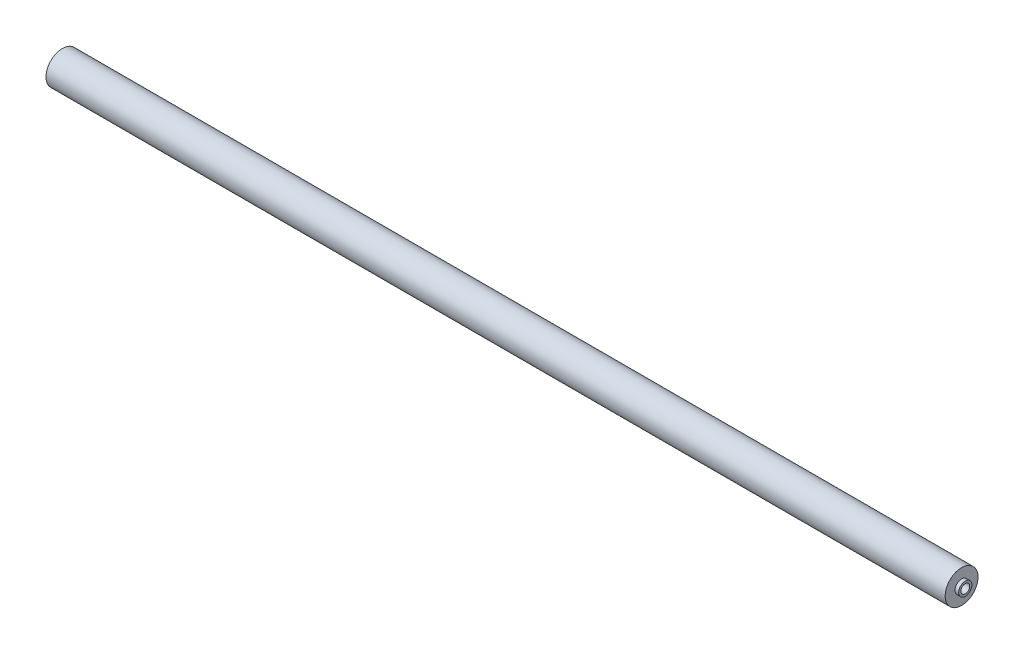
ISO-10303-21;
HEADER;
FILE_DESCRIPTION(('STEP AP214'),'2;1');
FILE_NAME('part.step','',(''),(''),'','','');
FILE_SCHEMA(('AUTOMOTIVE_DESIGN { 1 0 10303 214 1 1 1 1 }'));
ENDSEC;
DATA;
#1=APPLICATION_CONTEXT('core data for automotive mechanical design processes');
#2=APPLICATION_PROTOCOL_DEFINITION('international standard','automotive_design',2000,#1);
#3=PRODUCT_CONTEXT('',#1,'mechanical');
#4=PRODUCT('Part','Part','',(#3));
#5=PRODUCT_RELATED_PRODUCT_CATEGORY('part','',(#4));
#6=PRODUCT_DEFINITION_FORMATION('','',#4);
#7=PRODUCT_DEFINITION_CONTEXT('part definition',#1,'design');
#8=PRODUCT_DEFINITION('design','',#6,#7);
#9=PRODUCT_DEFINITION_SHAPE('','',#8);
#10=(LENGTH_UNIT() NAMED_UNIT(*) SI_UNIT(.MILLI.,.METRE.));
#11=(NAMED_UNIT(*) PLANE_ANGLE_UNIT() SI_UNIT($,.RADIAN.));
#12=(NAMED_UNIT(*) SI_UNIT($,.STERADIAN.) SOLID_ANGLE_UNIT());
#13=UNCERTAINTY_MEASURE_WITH_UNIT(LENGTH_MEASURE(1.E-05),#10,'distance_accuracy_value','');
#14=(GEOMETRIC_REPRESENTATION_CONTEXT(3) GLOBAL_UNCERTAINTY_ASSIGNED_CONTEXT((#13)) GLOBAL_UNIT_ASSIGNED_CONTEXT((#10,
#11,#12)) REPRESENTATION_CONTEXT('',''));
#15=CARTESIAN_POINT('',(0.,0.,0.));
#16=DIRECTION('',(0.,0.,1.));
#17=DIRECTION('',(1.,0.,0.));
#18=AXIS2_PLACEMENT_3D('',#15,#16,#17);
#19=CARTESIAN_POINT('',(-610.1,134.859540351136,0.));
#20=DIRECTION('',(1.,0.,0.));
#21=DIRECTION('',(0.,0.,-1.));
#22=AXIS2_PLACEMENT_3D('',#19,#20,#21);
#23=PLANE('',#22);
#24=CARTESIAN_POINT('',(-610.1,125.334540351136,0.));
#25=DIRECTION('',(-1.,0.,0.));
#26=DIRECTION('',(0.,0.,1.));
#27=AXIS2_PLACEMENT_3D('',#24,#25,#26);
#28=CIRCLE('',#27,4.56187038952058);
#29=CARTESIAN_POINT('',(-610.1,125.334540351136,4.56187038952058));
#30=VERTEX_POINT('',#29);
#31=EDGE_CURVE('E115',#30,#30,#28,.T.);
#32=ORIENTED_EDGE('',*,*,#31,.F.);
#33=EDGE_LOOP('',(#32));
#34=FACE_BOUND('',#33,.T.);
#35=CARTESIAN_POINT('',(-610.1,125.334540351136,0.));
#36=DIRECTION('',(-1.,0.,0.));
#37=DIRECTION('',(0.,0.,1.));
#38=AXIS2_PLACEMENT_3D('',#35,#36,#37);
#39=CIRCLE('',#38,9.52500000000003);
#40=CARTESIAN_POINT('',(-610.1,125.334540351136,9.52500000000003));
#41=VERTEX_POINT('',#40);
#42=EDGE_CURVE('E11',#41,#41,#39,.T.);
#43=ORIENTED_EDGE('',*,*,#42,.T.);
#44=EDGE_LOOP('',(#43));
#45=FACE_BOUND('',#44,.T.);
#46=ADVANCED_FACE('F32',(#34,#45),#23,.F.);
#47=CARTESIAN_POINT('',(-669.436923844671,125.334540351136,0.));
#48=DIRECTION('',(-1.,0.,0.));
#49=DIRECTION('',(0.,0.,1.));
#50=AXIS2_PLACEMENT_3D('',#47,#48,#49);
#51=CYLINDRICAL_SURFACE('',#50,9.52500000000002);
#52=ORIENTED_EDGE('',*,*,#42,.F.);
#53=EDGE_LOOP('',(#52));
#54=FACE_BOUND('',#53,.T.);
#55=CARTESIAN_POINT('',(-88.9,125.334540351136,0.));
#56=DIRECTION('',(-1.,0.,0.));
#57=DIRECTION('',(0.,0.,1.));
#58=AXIS2_PLACEMENT_3D('',#55,#56,#57);
#59=CIRCLE('',#58,9.52500000000001);
#60=CARTESIAN_POINT('',(-88.9,125.334540351136,9.52500000000001));
#61=VERTEX_POINT('',#60);
#62=EDGE_CURVE('E39',#61,#61,#59,.T.);
#63=ORIENTED_EDGE('',*,*,#62,.T.);
#64=EDGE_LOOP('',(#63));
#65=FACE_BOUND('',#64,.T.);
#66=ADVANCED_FACE('F76',(#54,#65),#51,.T.);
#67=CARTESIAN_POINT('',(-88.8999999999999,134.859540351136,0.));
#68=DIRECTION('',(-1.,0.,0.));
#69=DIRECTION('',(0.,0.,1.));
#70=AXIS2_PLACEMENT_3D('',#67,#68,#69);
#71=PLANE('',#70);
#72=ORIENTED_EDGE('',*,*,#62,.F.);
#73=EDGE_LOOP('',(#72));
#74=FACE_BOUND('',#73,.T.);
#75=CARTESIAN_POINT('',(-88.9,125.334540351136,0.));
#76=DIRECTION('',(-1.,0.,0.));
#77=DIRECTION('',(0.,0.,1.));
#78=AXIS2_PLACEMENT_3D('',#75,#76,#77);
#79=CIRCLE('',#78,3.82166881173637);
#80=CARTESIAN_POINT('',(-88.9,125.334540351136,3.82166881173637));
#81=VERTEX_POINT('',#80);
#82=EDGE_CURVE('E71',#81,#81,#79,.T.);
#83=ORIENTED_EDGE('',*,*,#82,.T.);
#84=EDGE_LOOP('',(#83));
#85=FACE_BOUND('',#84,.T.);
#86=ADVANCED_FACE('F78',(#74,#85),#71,.F.);
#87=CARTESIAN_POINT('',(-669.436923844671,125.334540351136,0.));
#88=DIRECTION('',(-1.,0.,0.));
#89=DIRECTION('',(0.,0.,1.));
#90=AXIS2_PLACEMENT_3D('',#87,#88,#89);
#91=CYLINDRICAL_SURFACE('',#90,3.82166881173637);
#92=ORIENTED_EDGE('',*,*,#82,.F.);
#93=EDGE_LOOP('',(#92));
#94=FACE_BOUND('',#93,.T.);
#95=CARTESIAN_POINT('',(-86.7667228234836,125.334540351136,0.));
#96=DIRECTION('',(-1.,0.,0.));
#97=DIRECTION('',(0.,0.,1.));
#98=AXIS2_PLACEMENT_3D('',#95,#96,#97);
#99=CIRCLE('',#98,3.82166881173637);
#100=CARTESIAN_POINT('',(-86.7667228234836,125.334540351136,3.82166881173637));
#101=VERTEX_POINT('',#100);
#102=EDGE_CURVE('E68',#101,#101,#99,.T.);
#103=ORIENTED_EDGE('',*,*,#102,.T.);
#104=EDGE_LOOP('',(#103));
#105=FACE_BOUND('',#104,.T.);
#106=ADVANCED_FACE('F81',(#94,#105),#91,.T.);
#107=CARTESIAN_POINT('',(-86.7667228234836,129.156209162872,0.));
#108=DIRECTION('',(-1.,0.,0.));
#109=DIRECTION('',(0.,0.,1.));
#110=AXIS2_PLACEMENT_3D('',#107,#108,#109);
#111=PLANE('',#110);
#112=ORIENTED_EDGE('',*,*,#102,.F.);
#113=EDGE_LOOP('',(#112));
#114=FACE_BOUND('',#113,.T.);
#115=CARTESIAN_POINT('',(-86.7667228234836,125.334540351136,0.));
#116=DIRECTION('',(-1.,0.,0.));
#117=DIRECTION('',(0.,0.,1.));
#118=AXIS2_PLACEMENT_3D('',#115,#116,#117);
#119=CIRCLE('',#118,2.57361127371544);
#120=CARTESIAN_POINT('',(-86.7667228234836,125.334540351136,2.57361127371544));
#121=VERTEX_POINT('',#120);
#122=EDGE_CURVE('E59',#121,#121,#119,.T.);
#123=ORIENTED_EDGE('',*,*,#122,.T.);
#124=EDGE_LOOP('',(#123));
#125=FACE_BOUND('',#124,.T.);
#126=ADVANCED_FACE('F87',(#114,#125),#111,.F.);
#127=CARTESIAN_POINT('',(-669.436923844671,125.334540351136,0.));
#128=DIRECTION('',(-1.,0.,0.));
#129=DIRECTION('',(0.,0.,1.));
#130=AXIS2_PLACEMENT_3D('',#127,#128,#129);
#131=CYLINDRICAL_SURFACE('',#130,2.57361127371544);
#132=ORIENTED_EDGE('',*,*,#122,.F.);
#133=EDGE_LOOP('',(#132));
#134=FACE_BOUND('',#133,.T.);
#135=CARTESIAN_POINT('',(-91.5380564772477,125.334540351136,0.));
#136=DIRECTION('',(-1.,0.,0.));
#137=DIRECTION('',(0.,0.,1.));
#138=AXIS2_PLACEMENT_3D('',#135,#136,#137);
#139=CIRCLE('',#138,2.57361127371544);
#140=CARTESIAN_POINT('',(-91.5380564772477,125.334540351136,2.57361127371544));
#141=VERTEX_POINT('',#140);
#142=EDGE_CURVE('E55',#141,#141,#139,.T.);
#143=ORIENTED_EDGE('',*,*,#142,.T.);
#144=EDGE_LOOP('',(#143));
#145=FACE_BOUND('',#144,.T.);
#146=ADVANCED_FACE('F93',(#134,#145),#131,.F.);
#147=CARTESIAN_POINT('',(-93.3610656563957,125.334540351136,0.));
#148=DIRECTION('',(1.,0.,0.));
#149=DIRECTION('',(0.,0.,-1.));
#150=AXIS2_PLACEMENT_3D('',#147,#148,#149);
#151=CONICAL_SURFACE('',#150,0.,0.954490455959782);
#152=ORIENTED_EDGE('',*,*,#142,.F.);
#153=EDGE_LOOP('',(#152));
#154=FACE_BOUND('',#153,.T.);
#155=CARTESIAN_POINT('',(-93.3610656563957,125.334540351136,0.));
#156=VERTEX_POINT('',#155);
#157=VERTEX_LOOP('',#156);
#158=FACE_BOUND('',#157,.T.);
#159=ADVANCED_FACE('F49',(#154,#158),#151,.F.);
#160=CARTESIAN_POINT('',(-605.901094644352,125.334540351136,0.));
#161=DIRECTION('',(-1.,0.,0.));
#162=DIRECTION('',(0.,0.,1.));
#163=AXIS2_PLACEMENT_3D('',#160,#161,#162);
#164=CONICAL_SURFACE('',#163,2.57361127371544,1.11369591507846);
#165=CARTESIAN_POINT('',(-604.635283007468,125.334540351136,0.));
#166=VERTEX_POINT('',#165);
#167=VERTEX_LOOP('',#166);
#168=FACE_BOUND('',#167,.T.);
#169=CARTESIAN_POINT('',(-605.901094644352,125.334540351136,0.));
#170=DIRECTION('',(-1.,0.,0.));
#171=DIRECTION('',(0.,0.,1.));
#172=AXIS2_PLACEMENT_3D('',#169,#170,#171);
#173=CIRCLE('',#172,2.57361127371544);
#174=CARTESIAN_POINT('',(-605.901094644352,125.334540351136,2.57361127371544));
#175=VERTEX_POINT('',#174);
#176=EDGE_CURVE('E53',#175,#175,#173,.T.);
#177=ORIENTED_EDGE('',*,*,#176,.T.);
#178=EDGE_LOOP('',(#177));
#179=FACE_BOUND('',#178,.T.);
#180=ADVANCED_FACE('F45',(#168,#179),#164,.F.);
#181=CARTESIAN_POINT('',(-669.436923844671,125.334540351136,0.));
#182=DIRECTION('',(-1.,0.,0.));
#183=DIRECTION('',(0.,0.,1.));
#184=AXIS2_PLACEMENT_3D('',#181,#182,#183);
#185=CYLINDRICAL_SURFACE('',#184,2.57361127371544);
#186=ORIENTED_EDGE('',*,*,#176,.F.);
#187=EDGE_LOOP('',(#186));
#188=FACE_BOUND('',#187,.T.);
#189=CARTESIAN_POINT('',(-612.957851499431,125.334540351136,0.));
#190=DIRECTION('',(-1.,0.,0.));
#191=DIRECTION('',(0.,0.,1.));
#192=AXIS2_PLACEMENT_3D('',#189,#190,#191);
#193=CIRCLE('',#192,2.57361127371544);
#194=CARTESIAN_POINT('',(-612.957851499431,125.334540351136,2.57361127371544));
#195=VERTEX_POINT('',#194);
#196=EDGE_CURVE('E56',#195,#195,#193,.T.);
#197=ORIENTED_EDGE('',*,*,#196,.T.);
#198=EDGE_LOOP('',(#197));
#199=FACE_BOUND('',#198,.T.);
#200=ADVANCED_FACE('F48',(#188,#199),#185,.F.);
#201=CARTESIAN_POINT('',(-612.957851499431,129.896410740656,0.));
#202=DIRECTION('',(1.,0.,0.));
#203=DIRECTION('',(0.,0.,-1.));
#204=AXIS2_PLACEMENT_3D('',#201,#202,#203);
#205=PLANE('',#204);
#206=ORIENTED_EDGE('',*,*,#196,.F.);
#207=EDGE_LOOP('',(#206));
#208=FACE_BOUND('',#207,.T.);
#209=CARTESIAN_POINT('',(-612.957851499431,125.334540351136,0.));
#210=DIRECTION('',(-1.,0.,0.));
#211=DIRECTION('',(0.,0.,1.));
#212=AXIS2_PLACEMENT_3D('',#209,#210,#211);
#213=CIRCLE('',#212,4.56187038952058);
#214=CARTESIAN_POINT('',(-612.957851499431,125.334540351136,4.56187038952058));
#215=VERTEX_POINT('',#214);
#216=EDGE_CURVE('E62',#215,#215,#213,.T.);
#217=ORIENTED_EDGE('',*,*,#216,.T.);
#218=EDGE_LOOP('',(#217));
#219=FACE_BOUND('',#218,.T.);
#220=ADVANCED_FACE('F122',(#208,#219),#205,.F.);
#221=CARTESIAN_POINT('',(-669.436923844671,125.334540351136,0.));
#222=DIRECTION('',(-1.,0.,0.));
#223=DIRECTION('',(0.,0.,1.));
#224=AXIS2_PLACEMENT_3D('',#221,#222,#223);
#225=CYLINDRICAL_SURFACE('',#224,4.56187038952058);
#226=ORIENTED_EDGE('',*,*,#216,.F.);
#227=EDGE_LOOP('',(#226));
#228=FACE_BOUND('',#227,.T.);
#229=ORIENTED_EDGE('',*,*,#31,.T.);
#230=EDGE_LOOP('',(#229));
#231=FACE_BOUND('',#230,.T.);
#232=ADVANCED_FACE('F124',(#228,#231),#225,.T.);
#233=CLOSED_SHELL('',(#46,#66,#86,#106,#126,#146,#159,#180,#200,#220,#232));
#234=MANIFOLD_SOLID_BREP('B2',#233);
#235=ADVANCED_BREP_SHAPE_REPRESENTATION('',(#18,#234),#14);
#236=SHAPE_DEFINITION_REPRESENTATION(#9,#235);
ENDSEC;
END-ISO-10303-21;
